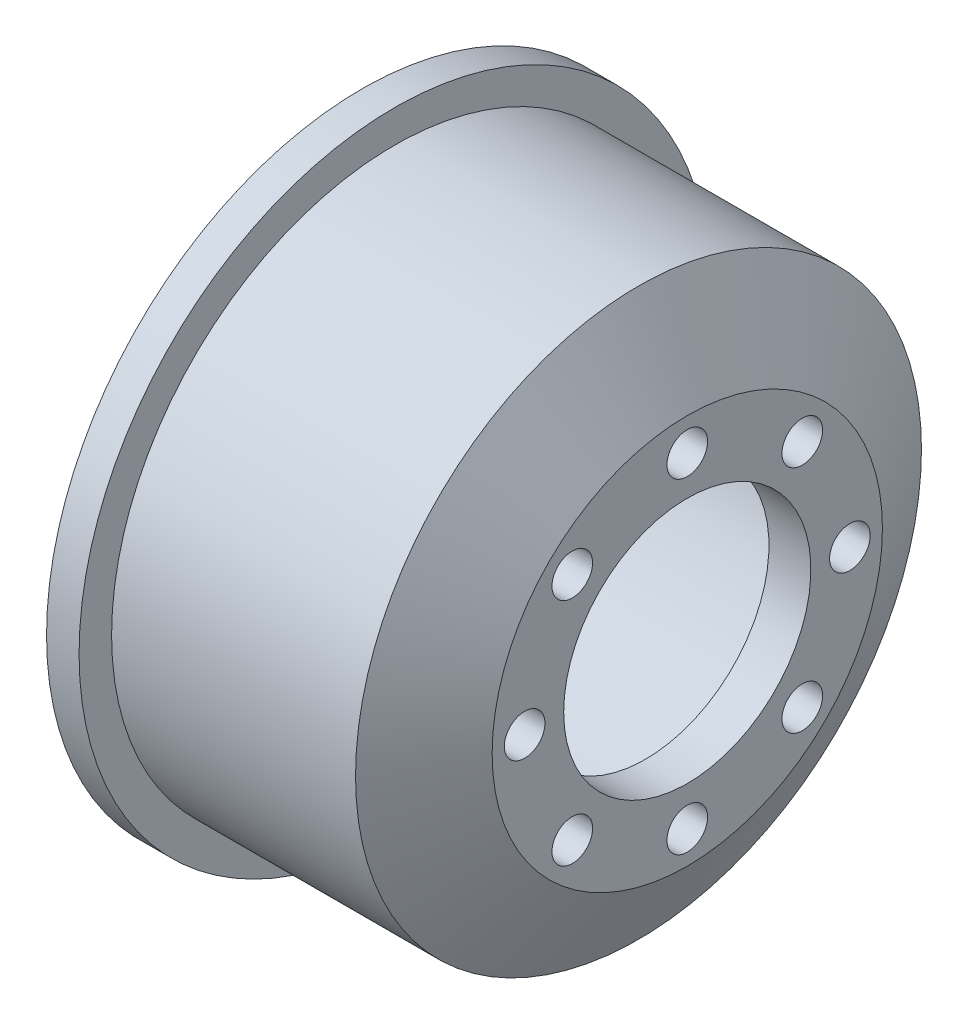
ISO-10303-21;
HEADER;
FILE_DESCRIPTION(('STEP AP214'),'2;1');
FILE_NAME('part.step','',(''),(''),'','','');
FILE_SCHEMA(('AUTOMOTIVE_DESIGN { 1 0 10303 214 1 1 1 1 }'));
ENDSEC;
DATA;
#1=APPLICATION_CONTEXT('core data for automotive mechanical design processes');
#2=APPLICATION_PROTOCOL_DEFINITION('international standard','automotive_design',2000,#1);
#3=PRODUCT_CONTEXT('',#1,'mechanical');
#4=PRODUCT('Part','Part','',(#3));
#5=PRODUCT_RELATED_PRODUCT_CATEGORY('part','',(#4));
#6=PRODUCT_DEFINITION_FORMATION('','',#4);
#7=PRODUCT_DEFINITION_CONTEXT('part definition',#1,'design');
#8=PRODUCT_DEFINITION('design','',#6,#7);
#9=PRODUCT_DEFINITION_SHAPE('','',#8);
#10=(LENGTH_UNIT() NAMED_UNIT(*) SI_UNIT(.MILLI.,.METRE.));
#11=(NAMED_UNIT(*) PLANE_ANGLE_UNIT() SI_UNIT($,.RADIAN.));
#12=(NAMED_UNIT(*) SI_UNIT($,.STERADIAN.) SOLID_ANGLE_UNIT());
#13=UNCERTAINTY_MEASURE_WITH_UNIT(LENGTH_MEASURE(1.E-05),#10,'distance_accuracy_value','');
#14=(GEOMETRIC_REPRESENTATION_CONTEXT(3) GLOBAL_UNCERTAINTY_ASSIGNED_CONTEXT((#13)) GLOBAL_UNIT_ASSIGNED_CONTEXT((#10,
#11,#12)) REPRESENTATION_CONTEXT('',''));
#15=CARTESIAN_POINT('',(0.,0.,0.));
#16=DIRECTION('',(0.,0.,1.));
#17=DIRECTION('',(1.,0.,0.));
#18=AXIS2_PLACEMENT_3D('',#15,#16,#17);
#19=CARTESIAN_POINT('',(-37.2788661687838,0.,0.));
#20=DIRECTION('',(-1.,0.,0.));
#21=DIRECTION('',(0.,0.,1.));
#22=AXIS2_PLACEMENT_3D('',#19,#20,#21);
#23=CYLINDRICAL_SURFACE('',#22,7.6);
#24=CARTESIAN_POINT('',(12.1398131593203,0.,0.));
#25=DIRECTION('',(-1.,0.,0.));
#26=DIRECTION('',(0.,0.,1.));
#27=AXIS2_PLACEMENT_3D('',#24,#25,#26);
#28=CIRCLE('',#27,7.6);
#29=CARTESIAN_POINT('',(12.1398131593203,0.,7.6));
#30=VERTEX_POINT('',#29);
#31=EDGE_CURVE('E10',#30,#30,#28,.T.);
#32=ORIENTED_EDGE('',*,*,#31,.F.);
#33=EDGE_LOOP('',(#32));
#34=FACE_BOUND('',#33,.T.);
#35=CARTESIAN_POINT('',(9.56299706719329,0.,0.));
#36=DIRECTION('',(-1.,0.,0.));
#37=DIRECTION('',(0.,0.,1.));
#38=AXIS2_PLACEMENT_3D('',#35,#36,#37);
#39=CIRCLE('',#38,7.6);
#40=CARTESIAN_POINT('',(9.56299706719329,0.,7.6));
#41=VERTEX_POINT('',#40);
#42=EDGE_CURVE('E72',#41,#41,#39,.T.);
#43=ORIENTED_EDGE('',*,*,#42,.T.);
#44=EDGE_LOOP('',(#43));
#45=FACE_BOUND('',#44,.T.);
#46=ADVANCED_FACE('F33',(#34,#45),#23,.F.);
#47=CARTESIAN_POINT('',(12.1398131593203,0.,-7.6));
#48=DIRECTION('',(-1.,0.,0.));
#49=DIRECTION('',(0.,0.,1.));
#50=AXIS2_PLACEMENT_3D('',#47,#48,#49);
#51=PLANE('',#50);
#52=CARTESIAN_POINT('',(12.1398131593203,10.,0.));
#53=DIRECTION('',(1.,0.,0.));
#54=DIRECTION('',(0.,0.,-1.));
#55=AXIS2_PLACEMENT_3D('',#52,#53,#54);
#56=CIRCLE('',#55,1.25);
#57=CARTESIAN_POINT('',(12.1398131593203,10.,-1.25));
#58=VERTEX_POINT('',#57);
#59=EDGE_CURVE('E53',#58,#58,#56,.T.);
#60=ORIENTED_EDGE('',*,*,#59,.F.);
#61=EDGE_LOOP('',(#60));
#62=FACE_BOUND('',#61,.T.);
#63=CARTESIAN_POINT('',(12.1398131593203,7.07106781186578,-7.0710678118656));
#64=DIRECTION('',(1.,0.,0.));
#65=DIRECTION('',(0.,0.,-1.));
#66=AXIS2_PLACEMENT_3D('',#63,#64,#65);
#67=CIRCLE('',#66,1.25000000000005);
#68=CARTESIAN_POINT('',(12.1398131593203,7.07106781186578,-8.32106781186565));
#69=VERTEX_POINT('',#68);
#70=EDGE_CURVE('E196',#69,#69,#67,.T.);
#71=ORIENTED_EDGE('',*,*,#70,.F.);
#72=EDGE_LOOP('',(#71));
#73=FACE_BOUND('',#72,.T.);
#74=CARTESIAN_POINT('',(12.1398131593203,4.24488671257339E-13,-10.0000000000004));
#75=DIRECTION('',(1.,0.,0.));
#76=DIRECTION('',(0.,0.,-1.));
#77=AXIS2_PLACEMENT_3D('',#74,#75,#76);
#78=CIRCLE('',#77,1.25000000000032);
#79=CARTESIAN_POINT('',(12.1398131593203,4.24488671257339E-13,-11.2500000000007));
#80=VERTEX_POINT('',#79);
#81=EDGE_CURVE('E199',#80,#80,#78,.T.);
#82=ORIENTED_EDGE('',*,*,#81,.F.);
#83=EDGE_LOOP('',(#82));
#84=FACE_BOUND('',#83,.T.);
#85=CARTESIAN_POINT('',(12.1398131593203,-7.07106781186517,-7.0710678118662));
#86=DIRECTION('',(1.,0.,0.));
#87=DIRECTION('',(0.,0.,-1.));
#88=AXIS2_PLACEMENT_3D('',#85,#86,#87);
#89=CIRCLE('',#88,1.25000000000066);
#90=CARTESIAN_POINT('',(12.1398131593203,-7.07106781186517,-8.32106781186686));
#91=VERTEX_POINT('',#90);
#92=EDGE_CURVE('E204',#91,#91,#89,.T.);
#93=ORIENTED_EDGE('',*,*,#92,.F.);
#94=EDGE_LOOP('',(#93));
#95=FACE_BOUND('',#94,.T.);
#96=CARTESIAN_POINT('',(12.1398131593203,-10.,-8.48977342514678E-13));
#97=DIRECTION('',(1.,0.,0.));
#98=DIRECTION('',(0.,0.,-1.));
#99=AXIS2_PLACEMENT_3D('',#96,#97,#98);
#100=CIRCLE('',#99,1.25000000000088);
#101=CARTESIAN_POINT('',(12.1398131593203,-10.,-1.25000000000173));
#102=VERTEX_POINT('',#101);
#103=EDGE_CURVE('E207',#102,#102,#100,.T.);
#104=ORIENTED_EDGE('',*,*,#103,.F.);
#105=EDGE_LOOP('',(#104));
#106=FACE_BOUND('',#105,.T.);
#107=CARTESIAN_POINT('',(12.1398131593203,-7.07106781186578,7.07106781186475));
#108=DIRECTION('',(1.,0.,0.));
#109=DIRECTION('',(0.,0.,-1.));
#110=AXIS2_PLACEMENT_3D('',#107,#108,#109);
#111=CIRCLE('',#110,1.25000000000086);
#112=CARTESIAN_POINT('',(12.1398131593203,-7.07106781186578,5.82106781186389));
#113=VERTEX_POINT('',#112);
#114=EDGE_CURVE('E210',#113,#113,#111,.T.);
#115=ORIENTED_EDGE('',*,*,#114,.F.);
#116=EDGE_LOOP('',(#115));
#117=FACE_BOUND('',#116,.T.);
#118=CARTESIAN_POINT('',(12.1398131593203,-4.25713318056486E-13,9.99999999999958));
#119=DIRECTION('',(1.,0.,0.));
#120=DIRECTION('',(0.,0.,-1.));
#121=AXIS2_PLACEMENT_3D('',#118,#119,#120);
#122=CIRCLE('',#121,1.25000000000063);
#123=CARTESIAN_POINT('',(12.1398131593203,-4.25713318056486E-13,8.74999999999895));
#124=VERTEX_POINT('',#123);
#125=EDGE_CURVE('E212',#124,#124,#122,.T.);
#126=ORIENTED_EDGE('',*,*,#125,.F.);
#127=EDGE_LOOP('',(#126));
#128=FACE_BOUND('',#127,.T.);
#129=CARTESIAN_POINT('',(12.1398131593203,7.07106781186517,7.07106781186535));
#130=DIRECTION('',(1.,0.,0.));
#131=DIRECTION('',(0.,0.,-1.));
#132=AXIS2_PLACEMENT_3D('',#129,#130,#131);
#133=CIRCLE('',#132,1.25000000000032);
#134=CARTESIAN_POINT('',(12.1398131593203,7.07106781186517,5.82106781186503));
#135=VERTEX_POINT('',#134);
#136=EDGE_CURVE('E84',#135,#135,#133,.T.);
#137=ORIENTED_EDGE('',*,*,#136,.F.);
#138=EDGE_LOOP('',(#137));
#139=FACE_BOUND('',#138,.T.);
#140=CARTESIAN_POINT('',(12.1398131593203,0.,0.));
#141=DIRECTION('',(-1.,0.,0.));
#142=DIRECTION('',(0.,0.,1.));
#143=AXIS2_PLACEMENT_3D('',#140,#141,#142);
#144=CIRCLE('',#143,12.);
#145=CARTESIAN_POINT('',(12.1398131593203,0.,12.));
#146=VERTEX_POINT('',#145);
#147=EDGE_CURVE('E40',#146,#146,#144,.T.);
#148=ORIENTED_EDGE('',*,*,#147,.F.);
#149=EDGE_LOOP('',(#148));
#150=FACE_BOUND('',#149,.T.);
#151=ORIENTED_EDGE('',*,*,#31,.T.);
#152=EDGE_LOOP('',(#151));
#153=FACE_BOUND('',#152,.T.);
#154=ADVANCED_FACE('F114',(#62,#73,#84,#95,#106,#117,#128,#139,#150,#153),#51,.F.);
#155=CARTESIAN_POINT('',(12.1398131593203,0.,0.));
#156=DIRECTION('',(-1.,0.,0.));
#157=DIRECTION('',(0.,0.,1.));
#158=AXIS2_PLACEMENT_3D('',#155,#156,#157);
#159=CONICAL_SURFACE('',#158,12.,1.06369782240256);
#160=CARTESIAN_POINT('',(9.13981315932029,0.,0.));
#161=DIRECTION('',(-1.,0.,0.));
#162=DIRECTION('',(0.,0.,1.));
#163=AXIS2_PLACEMENT_3D('',#160,#161,#162);
#164=CIRCLE('',#163,17.4);
#165=CARTESIAN_POINT('',(9.13981315932029,0.,17.4));
#166=VERTEX_POINT('',#165);
#167=EDGE_CURVE('E45',#166,#166,#164,.T.);
#168=ORIENTED_EDGE('',*,*,#167,.F.);
#169=EDGE_LOOP('',(#168));
#170=FACE_BOUND('',#169,.T.);
#171=ORIENTED_EDGE('',*,*,#147,.T.);
#172=EDGE_LOOP('',(#171));
#173=FACE_BOUND('',#172,.T.);
#174=ADVANCED_FACE('F111',(#170,#173),#159,.T.);
#175=CARTESIAN_POINT('',(-37.2788661687838,0.,0.));
#176=DIRECTION('',(-1.,0.,0.));
#177=DIRECTION('',(0.,0.,1.));
#178=AXIS2_PLACEMENT_3D('',#175,#176,#177);
#179=CYLINDRICAL_SURFACE('',#178,17.4);
#180=CARTESIAN_POINT('',(-5.86018684067971,0.,0.));
#181=DIRECTION('',(-1.,0.,0.));
#182=DIRECTION('',(0.,0.,1.));
#183=AXIS2_PLACEMENT_3D('',#180,#181,#182);
#184=CIRCLE('',#183,17.4);
#185=CARTESIAN_POINT('',(-5.86018684067971,0.,17.4));
#186=VERTEX_POINT('',#185);
#187=EDGE_CURVE('E104',#186,#186,#184,.T.);
#188=ORIENTED_EDGE('',*,*,#187,.F.);
#189=EDGE_LOOP('',(#188));
#190=FACE_BOUND('',#189,.T.);
#191=ORIENTED_EDGE('',*,*,#167,.T.);
#192=EDGE_LOOP('',(#191));
#193=FACE_BOUND('',#192,.T.);
#194=ADVANCED_FACE('F109',(#190,#193),#179,.T.);
#195=CARTESIAN_POINT('',(-5.86018684067971,0.,-19.4));
#196=DIRECTION('',(-1.,0.,0.));
#197=DIRECTION('',(0.,0.,1.));
#198=AXIS2_PLACEMENT_3D('',#195,#196,#197);
#199=PLANE('',#198);
#200=CARTESIAN_POINT('',(-5.86018684067971,0.,0.));
#201=DIRECTION('',(-1.,0.,0.));
#202=DIRECTION('',(0.,0.,1.));
#203=AXIS2_PLACEMENT_3D('',#200,#201,#202);
#204=CIRCLE('',#203,19.4);
#205=CARTESIAN_POINT('',(-5.86018684067971,0.,19.4));
#206=VERTEX_POINT('',#205);
#207=EDGE_CURVE('E101',#206,#206,#204,.T.);
#208=ORIENTED_EDGE('',*,*,#207,.F.);
#209=EDGE_LOOP('',(#208));
#210=FACE_BOUND('',#209,.T.);
#211=ORIENTED_EDGE('',*,*,#187,.T.);
#212=EDGE_LOOP('',(#211));
#213=FACE_BOUND('',#212,.T.);
#214=ADVANCED_FACE('F129',(#210,#213),#199,.F.);
#215=CARTESIAN_POINT('',(-37.2788661687838,0.,0.));
#216=DIRECTION('',(-1.,0.,0.));
#217=DIRECTION('',(0.,0.,1.));
#218=AXIS2_PLACEMENT_3D('',#215,#216,#217);
#219=CYLINDRICAL_SURFACE('',#218,19.4);
#220=CARTESIAN_POINT('',(-7.86018684067971,0.,0.));
#221=DIRECTION('',(-1.,0.,0.));
#222=DIRECTION('',(0.,0.,1.));
#223=AXIS2_PLACEMENT_3D('',#220,#221,#222);
#224=CIRCLE('',#223,19.4);
#225=CARTESIAN_POINT('',(-7.86018684067971,0.,19.4));
#226=VERTEX_POINT('',#225);
#227=EDGE_CURVE('E98',#226,#226,#224,.T.);
#228=ORIENTED_EDGE('',*,*,#227,.F.);
#229=EDGE_LOOP('',(#228));
#230=FACE_BOUND('',#229,.T.);
#231=ORIENTED_EDGE('',*,*,#207,.T.);
#232=EDGE_LOOP('',(#231));
#233=FACE_BOUND('',#232,.T.);
#234=ADVANCED_FACE('F133',(#230,#233),#219,.T.);
#235=CARTESIAN_POINT('',(-7.86018684067971,0.,-19.4));
#236=DIRECTION('',(1.,0.,0.));
#237=DIRECTION('',(0.,0.,-1.));
#238=AXIS2_PLACEMENT_3D('',#235,#236,#237);
#239=PLANE('',#238);
#240=CARTESIAN_POINT('',(-7.86018684067971,0.,0.));
#241=DIRECTION('',(-1.,0.,0.));
#242=DIRECTION('',(0.,0.,1.));
#243=AXIS2_PLACEMENT_3D('',#240,#241,#242);
#244=CIRCLE('',#243,18.4);
#245=CARTESIAN_POINT('',(-7.86018684067971,0.,18.4));
#246=VERTEX_POINT('',#245);
#247=EDGE_CURVE('E95',#246,#246,#244,.T.);
#248=ORIENTED_EDGE('',*,*,#247,.F.);
#249=EDGE_LOOP('',(#248));
#250=FACE_BOUND('',#249,.T.);
#251=ORIENTED_EDGE('',*,*,#227,.T.);
#252=EDGE_LOOP('',(#251));
#253=FACE_BOUND('',#252,.T.);
#254=ADVANCED_FACE('F137',(#250,#253),#239,.F.);
#255=CARTESIAN_POINT('',(-37.2788661687838,0.,0.));
#256=DIRECTION('',(-1.,0.,0.));
#257=DIRECTION('',(0.,0.,1.));
#258=AXIS2_PLACEMENT_3D('',#255,#256,#257);
#259=CYLINDRICAL_SURFACE('',#258,18.4);
#260=CARTESIAN_POINT('',(-7.36018684067971,0.,0.));
#261=DIRECTION('',(-1.,0.,0.));
#262=DIRECTION('',(0.,0.,1.));
#263=AXIS2_PLACEMENT_3D('',#260,#261,#262);
#264=CIRCLE('',#263,18.4);
#265=CARTESIAN_POINT('',(-7.36018684067971,0.,18.4));
#266=VERTEX_POINT('',#265);
#267=EDGE_CURVE('E92',#266,#266,#264,.T.);
#268=ORIENTED_EDGE('',*,*,#267,.F.);
#269=EDGE_LOOP('',(#268));
#270=FACE_BOUND('',#269,.T.);
#271=ORIENTED_EDGE('',*,*,#247,.T.);
#272=EDGE_LOOP('',(#271));
#273=FACE_BOUND('',#272,.T.);
#274=ADVANCED_FACE('F141',(#270,#273),#259,.F.);
#275=CARTESIAN_POINT('',(-7.36018684067971,0.,-14.55));
#276=DIRECTION('',(1.,0.,0.));
#277=DIRECTION('',(0.,0.,-1.));
#278=AXIS2_PLACEMENT_3D('',#275,#276,#277);
#279=PLANE('',#278);
#280=CARTESIAN_POINT('',(-7.36018684067971,0.,0.));
#281=DIRECTION('',(-1.,0.,0.));
#282=DIRECTION('',(0.,0.,1.));
#283=AXIS2_PLACEMENT_3D('',#280,#281,#282);
#284=CIRCLE('',#283,14.55);
#285=CARTESIAN_POINT('',(-7.36018684067971,0.,14.55));
#286=VERTEX_POINT('',#285);
#287=EDGE_CURVE('E89',#286,#286,#284,.T.);
#288=ORIENTED_EDGE('',*,*,#287,.F.);
#289=EDGE_LOOP('',(#288));
#290=FACE_BOUND('',#289,.T.);
#291=ORIENTED_EDGE('',*,*,#267,.T.);
#292=EDGE_LOOP('',(#291));
#293=FACE_BOUND('',#292,.T.);
#294=ADVANCED_FACE('F145',(#290,#293),#279,.F.);
#295=CARTESIAN_POINT('',(-37.2788661687838,0.,0.));
#296=DIRECTION('',(-1.,0.,0.));
#297=DIRECTION('',(0.,0.,1.));
#298=AXIS2_PLACEMENT_3D('',#295,#296,#297);
#299=CYLINDRICAL_SURFACE('',#298,14.55);
#300=CARTESIAN_POINT('',(8.25130562243934,0.,0.));
#301=DIRECTION('',(-1.,0.,0.));
#302=DIRECTION('',(0.,0.,1.));
#303=AXIS2_PLACEMENT_3D('',#300,#301,#302);
#304=CIRCLE('',#303,14.55);
#305=CARTESIAN_POINT('',(8.25130562243934,0.,14.55));
#306=VERTEX_POINT('',#305);
#307=EDGE_CURVE('E81',#306,#306,#304,.T.);
#308=ORIENTED_EDGE('',*,*,#307,.F.);
#309=EDGE_LOOP('',(#308));
#310=FACE_BOUND('',#309,.T.);
#311=ORIENTED_EDGE('',*,*,#287,.T.);
#312=EDGE_LOOP('',(#311));
#313=FACE_BOUND('',#312,.T.);
#314=ADVANCED_FACE('F149',(#310,#313),#299,.F.);
#315=CARTESIAN_POINT('',(8.25130562243934,0.,0.));
#316=DIRECTION('',(-1.,0.,0.));
#317=DIRECTION('',(0.,0.,1.));
#318=AXIS2_PLACEMENT_3D('',#315,#316,#317);
#319=CONICAL_SURFACE('',#318,14.55,1.06369782240256);
#320=CARTESIAN_POINT('',(9.56299706719329,0.,0.));
#321=DIRECTION('',(-1.,0.,0.));
#322=DIRECTION('',(0.,0.,1.));
#323=AXIS2_PLACEMENT_3D('',#320,#321,#322);
#324=CIRCLE('',#323,12.1889553994429);
#325=CARTESIAN_POINT('',(9.56299706719329,0.,12.1889553994429));
#326=VERTEX_POINT('',#325);
#327=EDGE_CURVE('E76',#326,#326,#324,.T.);
#328=ORIENTED_EDGE('',*,*,#327,.F.);
#329=EDGE_LOOP('',(#328));
#330=FACE_BOUND('',#329,.T.);
#331=ORIENTED_EDGE('',*,*,#307,.T.);
#332=EDGE_LOOP('',(#331));
#333=FACE_BOUND('',#332,.T.);
#334=ADVANCED_FACE('F153',(#330,#333),#319,.F.);
#335=CARTESIAN_POINT('',(9.56299706719329,0.,-12.1889553994429));
#336=DIRECTION('',(1.,0.,0.));
#337=DIRECTION('',(0.,0.,-1.));
#338=AXIS2_PLACEMENT_3D('',#335,#336,#337);
#339=PLANE('',#338);
#340=CARTESIAN_POINT('',(9.56299706719329,10.,0.));
#341=DIRECTION('',(1.,0.,0.));
#342=DIRECTION('',(0.,0.,-1.));
#343=AXIS2_PLACEMENT_3D('',#340,#341,#342);
#344=CIRCLE('',#343,1.25);
#345=CARTESIAN_POINT('',(9.56299706719329,10.,-1.25));
#346=VERTEX_POINT('',#345);
#347=EDGE_CURVE('E36',#346,#346,#344,.T.);
#348=ORIENTED_EDGE('',*,*,#347,.T.);
#349=EDGE_LOOP('',(#348));
#350=FACE_BOUND('',#349,.T.);
#351=CARTESIAN_POINT('',(9.56299706719329,7.07106781186578,-7.0710678118656));
#352=DIRECTION('',(1.,0.,0.));
#353=DIRECTION('',(0.,0.,-1.));
#354=AXIS2_PLACEMENT_3D('',#351,#352,#353);
#355=CIRCLE('',#354,1.25000000000005);
#356=CARTESIAN_POINT('',(9.56299706719329,7.07106781186578,-8.32106781186565));
#357=VERTEX_POINT('',#356);
#358=EDGE_CURVE('E67',#357,#357,#355,.T.);
#359=ORIENTED_EDGE('',*,*,#358,.T.);
#360=EDGE_LOOP('',(#359));
#361=FACE_BOUND('',#360,.T.);
#362=CARTESIAN_POINT('',(9.56299706719329,4.24488671257339E-13,-10.0000000000004));
#363=DIRECTION('',(1.,0.,0.));
#364=DIRECTION('',(0.,0.,-1.));
#365=AXIS2_PLACEMENT_3D('',#362,#363,#364);
#366=CIRCLE('',#365,1.25000000000032);
#367=CARTESIAN_POINT('',(9.56299706719329,4.24488671257339E-13,-11.2500000000007));
#368=VERTEX_POINT('',#367);
#369=EDGE_CURVE('E65',#368,#368,#366,.T.);
#370=ORIENTED_EDGE('',*,*,#369,.T.);
#371=EDGE_LOOP('',(#370));
#372=FACE_BOUND('',#371,.T.);
#373=CARTESIAN_POINT('',(9.56299706719329,-7.07106781186517,-7.0710678118662));
#374=DIRECTION('',(1.,0.,0.));
#375=DIRECTION('',(0.,0.,-1.));
#376=AXIS2_PLACEMENT_3D('',#373,#374,#375);
#377=CIRCLE('',#376,1.25000000000066);
#378=CARTESIAN_POINT('',(9.56299706719329,-7.07106781186517,-8.32106781186686));
#379=VERTEX_POINT('',#378);
#380=EDGE_CURVE('E62',#379,#379,#377,.T.);
#381=ORIENTED_EDGE('',*,*,#380,.T.);
#382=EDGE_LOOP('',(#381));
#383=FACE_BOUND('',#382,.T.);
#384=CARTESIAN_POINT('',(9.56299706719329,-10.,-8.48977342514678E-13));
#385=DIRECTION('',(1.,0.,0.));
#386=DIRECTION('',(0.,0.,-1.));
#387=AXIS2_PLACEMENT_3D('',#384,#385,#386);
#388=CIRCLE('',#387,1.25000000000088);
#389=CARTESIAN_POINT('',(9.56299706719329,-10.,-1.25000000000173));
#390=VERTEX_POINT('',#389);
#391=EDGE_CURVE('E59',#390,#390,#388,.T.);
#392=ORIENTED_EDGE('',*,*,#391,.T.);
#393=EDGE_LOOP('',(#392));
#394=FACE_BOUND('',#393,.T.);
#395=CARTESIAN_POINT('',(9.56299706719329,-7.07106781186578,7.07106781186475));
#396=DIRECTION('',(1.,0.,0.));
#397=DIRECTION('',(0.,0.,-1.));
#398=AXIS2_PLACEMENT_3D('',#395,#396,#397);
#399=CIRCLE('',#398,1.25000000000086);
#400=CARTESIAN_POINT('',(9.56299706719329,-7.07106781186578,5.82106781186389));
#401=VERTEX_POINT('',#400);
#402=EDGE_CURVE('E56',#401,#401,#399,.T.);
#403=ORIENTED_EDGE('',*,*,#402,.T.);
#404=EDGE_LOOP('',(#403));
#405=FACE_BOUND('',#404,.T.);
#406=CARTESIAN_POINT('',(9.56299706719329,-4.25713318056486E-13,9.99999999999958));
#407=DIRECTION('',(1.,0.,0.));
#408=DIRECTION('',(0.,0.,-1.));
#409=AXIS2_PLACEMENT_3D('',#406,#407,#408);
#410=CIRCLE('',#409,1.25000000000063);
#411=CARTESIAN_POINT('',(9.56299706719329,-4.25713318056486E-13,8.74999999999895));
#412=VERTEX_POINT('',#411);
#413=EDGE_CURVE('E52',#412,#412,#410,.T.);
#414=ORIENTED_EDGE('',*,*,#413,.T.);
#415=EDGE_LOOP('',(#414));
#416=FACE_BOUND('',#415,.T.);
#417=CARTESIAN_POINT('',(9.56299706719329,7.07106781186517,7.07106781186535));
#418=DIRECTION('',(1.,0.,0.));
#419=DIRECTION('',(0.,0.,-1.));
#420=AXIS2_PLACEMENT_3D('',#417,#418,#419);
#421=CIRCLE('',#420,1.25000000000032);
#422=CARTESIAN_POINT('',(9.56299706719329,7.07106781186517,5.82106781186503));
#423=VERTEX_POINT('',#422);
#424=EDGE_CURVE('E49',#423,#423,#421,.T.);
#425=ORIENTED_EDGE('',*,*,#424,.T.);
#426=EDGE_LOOP('',(#425));
#427=FACE_BOUND('',#426,.T.);
#428=ORIENTED_EDGE('',*,*,#42,.F.);
#429=EDGE_LOOP('',(#428));
#430=FACE_BOUND('',#429,.T.);
#431=ORIENTED_EDGE('',*,*,#327,.T.);
#432=EDGE_LOOP('',(#431));
#433=FACE_BOUND('',#432,.T.);
#434=ADVANCED_FACE('F157',(#350,#361,#372,#383,#394,#405,#416,#427,#430,#433),#339,.F.);
#435=CARTESIAN_POINT('',(-7.86018684067971,7.07106781186517,7.07106781186535));
#436=DIRECTION('',(1.,0.,0.));
#437=DIRECTION('',(0.,0.,-1.));
#438=AXIS2_PLACEMENT_3D('',#435,#436,#437);
#439=CYLINDRICAL_SURFACE('',#438,1.25000000000032);
#440=ORIENTED_EDGE('',*,*,#136,.T.);
#441=EDGE_LOOP('',(#440));
#442=FACE_BOUND('',#441,.T.);
#443=ORIENTED_EDGE('',*,*,#424,.F.);
#444=EDGE_LOOP('',(#443));
#445=FACE_BOUND('',#444,.T.);
#446=ADVANCED_FACE('F161',(#442,#445),#439,.F.);
#447=CARTESIAN_POINT('',(-7.86018684067971,-4.25713318056486E-13,9.99999999999958));
#448=DIRECTION('',(1.,0.,0.));
#449=DIRECTION('',(0.,0.,-1.));
#450=AXIS2_PLACEMENT_3D('',#447,#448,#449);
#451=CYLINDRICAL_SURFACE('',#450,1.25000000000063);
#452=ORIENTED_EDGE('',*,*,#125,.T.);
#453=EDGE_LOOP('',(#452));
#454=FACE_BOUND('',#453,.T.);
#455=ORIENTED_EDGE('',*,*,#413,.F.);
#456=EDGE_LOOP('',(#455));
#457=FACE_BOUND('',#456,.T.);
#458=ADVANCED_FACE('F164',(#454,#457),#451,.F.);
#459=CARTESIAN_POINT('',(-7.86018684067971,-7.07106781186578,7.07106781186475));
#460=DIRECTION('',(1.,0.,0.));
#461=DIRECTION('',(0.,0.,-1.));
#462=AXIS2_PLACEMENT_3D('',#459,#460,#461);
#463=CYLINDRICAL_SURFACE('',#462,1.25000000000086);
#464=ORIENTED_EDGE('',*,*,#114,.T.);
#465=EDGE_LOOP('',(#464));
#466=FACE_BOUND('',#465,.T.);
#467=ORIENTED_EDGE('',*,*,#402,.F.);
#468=EDGE_LOOP('',(#467));
#469=FACE_BOUND('',#468,.T.);
#470=ADVANCED_FACE('F168',(#466,#469),#463,.F.);
#471=CARTESIAN_POINT('',(-7.86018684067971,-10.,-8.48977342514678E-13));
#472=DIRECTION('',(1.,0.,0.));
#473=DIRECTION('',(0.,0.,-1.));
#474=AXIS2_PLACEMENT_3D('',#471,#472,#473);
#475=CYLINDRICAL_SURFACE('',#474,1.25000000000088);
#476=ORIENTED_EDGE('',*,*,#103,.T.);
#477=EDGE_LOOP('',(#476));
#478=FACE_BOUND('',#477,.T.);
#479=ORIENTED_EDGE('',*,*,#391,.F.);
#480=EDGE_LOOP('',(#479));
#481=FACE_BOUND('',#480,.T.);
#482=ADVANCED_FACE('F172',(#478,#481),#475,.F.);
#483=CARTESIAN_POINT('',(-7.86018684067971,-7.07106781186517,-7.0710678118662));
#484=DIRECTION('',(1.,0.,0.));
#485=DIRECTION('',(0.,0.,-1.));
#486=AXIS2_PLACEMENT_3D('',#483,#484,#485);
#487=CYLINDRICAL_SURFACE('',#486,1.25000000000066);
#488=ORIENTED_EDGE('',*,*,#92,.T.);
#489=EDGE_LOOP('',(#488));
#490=FACE_BOUND('',#489,.T.);
#491=ORIENTED_EDGE('',*,*,#380,.F.);
#492=EDGE_LOOP('',(#491));
#493=FACE_BOUND('',#492,.T.);
#494=ADVANCED_FACE('F176',(#490,#493),#487,.F.);
#495=CARTESIAN_POINT('',(-7.86018684067971,4.24488671257339E-13,-10.0000000000004));
#496=DIRECTION('',(1.,0.,0.));
#497=DIRECTION('',(0.,0.,-1.));
#498=AXIS2_PLACEMENT_3D('',#495,#496,#497);
#499=CYLINDRICAL_SURFACE('',#498,1.25000000000032);
#500=ORIENTED_EDGE('',*,*,#81,.T.);
#501=EDGE_LOOP('',(#500));
#502=FACE_BOUND('',#501,.T.);
#503=ORIENTED_EDGE('',*,*,#369,.F.);
#504=EDGE_LOOP('',(#503));
#505=FACE_BOUND('',#504,.T.);
#506=ADVANCED_FACE('F180',(#502,#505),#499,.F.);
#507=CARTESIAN_POINT('',(-7.86018684067971,7.07106781186578,-7.0710678118656));
#508=DIRECTION('',(1.,0.,0.));
#509=DIRECTION('',(0.,0.,-1.));
#510=AXIS2_PLACEMENT_3D('',#507,#508,#509);
#511=CYLINDRICAL_SURFACE('',#510,1.25000000000005);
#512=ORIENTED_EDGE('',*,*,#70,.T.);
#513=EDGE_LOOP('',(#512));
#514=FACE_BOUND('',#513,.T.);
#515=ORIENTED_EDGE('',*,*,#358,.F.);
#516=EDGE_LOOP('',(#515));
#517=FACE_BOUND('',#516,.T.);
#518=ADVANCED_FACE('F184',(#514,#517),#511,.F.);
#519=CARTESIAN_POINT('',(-7.86018684067971,10.,0.));
#520=DIRECTION('',(1.,0.,0.));
#521=DIRECTION('',(0.,0.,-1.));
#522=AXIS2_PLACEMENT_3D('',#519,#520,#521);
#523=CYLINDRICAL_SURFACE('',#522,1.25);
#524=ORIENTED_EDGE('',*,*,#59,.T.);
#525=EDGE_LOOP('',(#524));
#526=FACE_BOUND('',#525,.T.);
#527=ORIENTED_EDGE('',*,*,#347,.F.);
#528=EDGE_LOOP('',(#527));
#529=FACE_BOUND('',#528,.T.);
#530=ADVANCED_FACE('F188',(#526,#529),#523,.F.);
#531=CLOSED_SHELL('',(#46,#154,#174,#194,#214,#234,#254,#274,#294,#314,#334,#434,#446,#458,#470,
#482,#494,#506,#518,#530));
#532=MANIFOLD_SOLID_BREP('B2',#531);
#533=ADVANCED_BREP_SHAPE_REPRESENTATION('',(#18,#532),#14);
#534=SHAPE_DEFINITION_REPRESENTATION(#9,#533);
ENDSEC;
END-ISO-10303-21;
